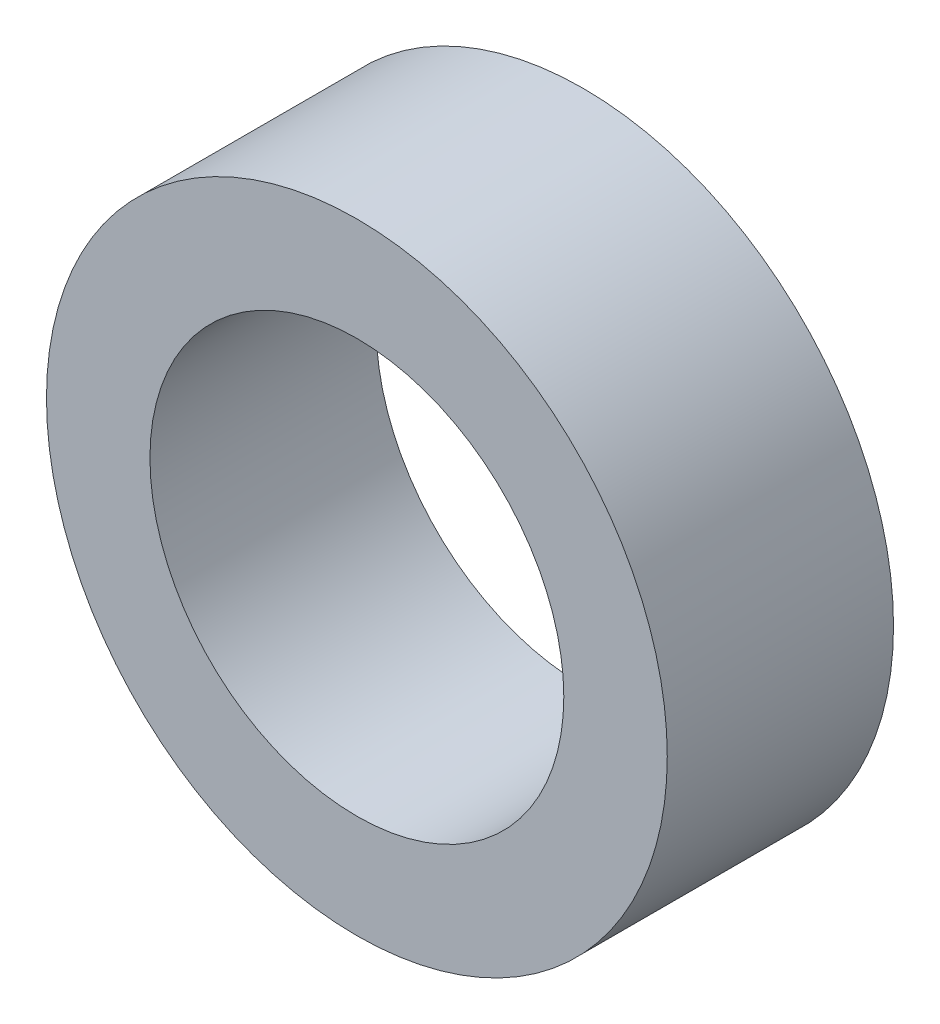
ISO-10303-21;
HEADER;
FILE_DESCRIPTION(('STEP AP214'),'2;1');
FILE_NAME('part.step','',(''),(''),'','','');
FILE_SCHEMA(('AUTOMOTIVE_DESIGN { 1 0 10303 214 1 1 1 1 }'));
ENDSEC;
DATA;
#1=APPLICATION_CONTEXT('core data for automotive mechanical design processes');
#2=APPLICATION_PROTOCOL_DEFINITION('international standard','automotive_design',2000,#1);
#3=PRODUCT_CONTEXT('',#1,'mechanical');
#4=PRODUCT('Part','Part','',(#3));
#5=PRODUCT_RELATED_PRODUCT_CATEGORY('part','',(#4));
#6=PRODUCT_DEFINITION_FORMATION('','',#4);
#7=PRODUCT_DEFINITION_CONTEXT('part definition',#1,'design');
#8=PRODUCT_DEFINITION('design','',#6,#7);
#9=PRODUCT_DEFINITION_SHAPE('','',#8);
#10=(LENGTH_UNIT() NAMED_UNIT(*) SI_UNIT(.MILLI.,.METRE.));
#11=(NAMED_UNIT(*) PLANE_ANGLE_UNIT() SI_UNIT($,.RADIAN.));
#12=(NAMED_UNIT(*) SI_UNIT($,.STERADIAN.) SOLID_ANGLE_UNIT());
#13=UNCERTAINTY_MEASURE_WITH_UNIT(LENGTH_MEASURE(1.E-05),#10,'distance_accuracy_value','');
#14=(GEOMETRIC_REPRESENTATION_CONTEXT(3) GLOBAL_UNCERTAINTY_ASSIGNED_CONTEXT((#13)) GLOBAL_UNIT_ASSIGNED_CONTEXT((#10,
#11,#12)) REPRESENTATION_CONTEXT('',''));
#15=CARTESIAN_POINT('',(0.,0.,0.));
#16=DIRECTION('',(0.,0.,1.));
#17=DIRECTION('',(1.,0.,0.));
#18=AXIS2_PLACEMENT_3D('',#15,#16,#17);
#19=CARTESIAN_POINT('',(-32.9,-31.,1.64));
#20=DIRECTION('',(0.,0.,1.));
#21=DIRECTION('',(-1.,0.,0.));
#22=AXIS2_PLACEMENT_3D('',#19,#20,#21);
#23=CYLINDRICAL_SURFACE('',#22,2.25);
#24=CARTESIAN_POINT('',(-32.9,-31.,1.64));
#25=DIRECTION('',(0.,0.,1.));
#26=DIRECTION('',(1.,0.,0.));
#27=AXIS2_PLACEMENT_3D('',#24,#25,#26);
#28=CIRCLE('',#27,2.25);
#29=CARTESIAN_POINT('',(-30.65,-31.,1.64));
#30=VERTEX_POINT('',#29);
#31=EDGE_CURVE('E26',#30,#30,#28,.T.);
#32=ORIENTED_EDGE('',*,*,#31,.F.);
#33=EDGE_LOOP('',(#32));
#34=FACE_BOUND('',#33,.T.);
#35=CARTESIAN_POINT('',(-32.9,-31.,0.));
#36=DIRECTION('',(0.,0.,1.));
#37=DIRECTION('',(1.,0.,0.));
#38=AXIS2_PLACEMENT_3D('',#35,#36,#37);
#39=CIRCLE('',#38,2.25);
#40=CARTESIAN_POINT('',(-30.65,-31.,0.));
#41=VERTEX_POINT('',#40);
#42=EDGE_CURVE('E51',#41,#41,#39,.T.);
#43=ORIENTED_EDGE('',*,*,#42,.T.);
#44=EDGE_LOOP('',(#43));
#45=FACE_BOUND('',#44,.T.);
#46=ADVANCED_FACE('F16',(#34,#45),#23,.T.);
#47=CARTESIAN_POINT('',(-32.9,-31.,1.64));
#48=DIRECTION('',(0.,0.,1.));
#49=DIRECTION('',(-1.,0.,0.));
#50=AXIS2_PLACEMENT_3D('',#47,#48,#49);
#51=CYLINDRICAL_SURFACE('',#50,1.5);
#52=CARTESIAN_POINT('',(-32.9,-31.,1.64));
#53=DIRECTION('',(0.,0.,1.));
#54=DIRECTION('',(1.,0.,0.));
#55=AXIS2_PLACEMENT_3D('',#52,#53,#54);
#56=CIRCLE('',#55,1.5);
#57=CARTESIAN_POINT('',(-31.4,-31.,1.64));
#58=VERTEX_POINT('',#57);
#59=EDGE_CURVE('E11',#58,#58,#56,.T.);
#60=ORIENTED_EDGE('',*,*,#59,.T.);
#61=EDGE_LOOP('',(#60));
#62=FACE_BOUND('',#61,.T.);
#63=CARTESIAN_POINT('',(-32.9,-31.,0.));
#64=DIRECTION('',(0.,0.,1.));
#65=DIRECTION('',(1.,0.,0.));
#66=AXIS2_PLACEMENT_3D('',#63,#64,#65);
#67=CIRCLE('',#66,1.5);
#68=CARTESIAN_POINT('',(-31.4,-31.,0.));
#69=VERTEX_POINT('',#68);
#70=EDGE_CURVE('E45',#69,#69,#67,.T.);
#71=ORIENTED_EDGE('',*,*,#70,.F.);
#72=EDGE_LOOP('',(#71));
#73=FACE_BOUND('',#72,.T.);
#74=ADVANCED_FACE('F18',(#62,#73),#51,.F.);
#75=CARTESIAN_POINT('',(-17.7,-16.75,1.64));
#76=DIRECTION('',(0.,0.,1.));
#77=DIRECTION('',(1.,0.,0.));
#78=AXIS2_PLACEMENT_3D('',#75,#76,#77);
#79=PLANE('',#78);
#80=ORIENTED_EDGE('',*,*,#59,.F.);
#81=EDGE_LOOP('',(#80));
#82=FACE_BOUND('',#81,.T.);
#83=ORIENTED_EDGE('',*,*,#31,.T.);
#84=EDGE_LOOP('',(#83));
#85=FACE_BOUND('',#84,.T.);
#86=ADVANCED_FACE('F62',(#82,#85),#79,.T.);
#87=CARTESIAN_POINT('',(-17.7,-16.75,0.));
#88=DIRECTION('',(0.,0.,1.));
#89=DIRECTION('',(1.,0.,0.));
#90=AXIS2_PLACEMENT_3D('',#87,#88,#89);
#91=PLANE('',#90);
#92=ORIENTED_EDGE('',*,*,#70,.T.);
#93=EDGE_LOOP('',(#92));
#94=FACE_BOUND('',#93,.T.);
#95=ORIENTED_EDGE('',*,*,#42,.F.);
#96=EDGE_LOOP('',(#95));
#97=FACE_BOUND('',#96,.T.);
#98=ADVANCED_FACE('F72',(#94,#97),#91,.F.);
#99=CLOSED_SHELL('',(#46,#74,#86,#98));
#100=MANIFOLD_SOLID_BREP('B1',#99);
#101=ADVANCED_BREP_SHAPE_REPRESENTATION('',(#18,#100),#14);
#102=SHAPE_DEFINITION_REPRESENTATION(#9,#101);
ENDSEC;
END-ISO-10303-21;
